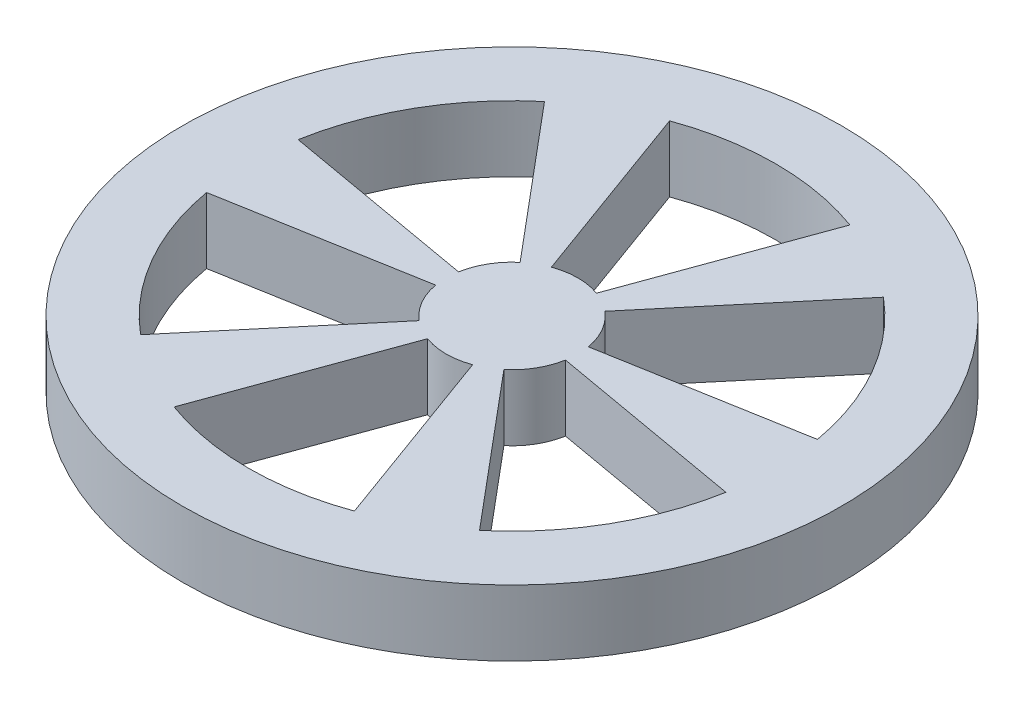
ISO-10303-21;
HEADER;
FILE_DESCRIPTION(('STEP AP214'),'2;1');
FILE_NAME('part.step','',(''),(''),'','','');
FILE_SCHEMA(('AUTOMOTIVE_DESIGN { 1 0 10303 214 1 1 1 1 }'));
ENDSEC;
DATA;
#1=APPLICATION_CONTEXT('core data for automotive mechanical design processes');
#2=APPLICATION_PROTOCOL_DEFINITION('international standard','automotive_design',2000,#1);
#3=PRODUCT_CONTEXT('',#1,'mechanical');
#4=PRODUCT('Part','Part','',(#3));
#5=PRODUCT_RELATED_PRODUCT_CATEGORY('part','',(#4));
#6=PRODUCT_DEFINITION_FORMATION('','',#4);
#7=PRODUCT_DEFINITION_CONTEXT('part definition',#1,'design');
#8=PRODUCT_DEFINITION('design','',#6,#7);
#9=PRODUCT_DEFINITION_SHAPE('','',#8);
#10=(LENGTH_UNIT() NAMED_UNIT(*) SI_UNIT(.MILLI.,.METRE.));
#11=(NAMED_UNIT(*) PLANE_ANGLE_UNIT() SI_UNIT($,.RADIAN.));
#12=(NAMED_UNIT(*) SI_UNIT($,.STERADIAN.) SOLID_ANGLE_UNIT());
#13=UNCERTAINTY_MEASURE_WITH_UNIT(LENGTH_MEASURE(1.E-05),#10,'distance_accuracy_value','');
#14=(GEOMETRIC_REPRESENTATION_CONTEXT(3) GLOBAL_UNCERTAINTY_ASSIGNED_CONTEXT((#13)) GLOBAL_UNIT_ASSIGNED_CONTEXT((#10,
#11,#12)) REPRESENTATION_CONTEXT('',''));
#15=CARTESIAN_POINT('',(0.,0.,0.));
#16=DIRECTION('',(0.,0.,1.));
#17=DIRECTION('',(1.,0.,0.));
#18=AXIS2_PLACEMENT_3D('',#15,#16,#17);
#19=CARTESIAN_POINT('',(0.,10.,0.));
#20=DIRECTION('',(0.,1.,0.));
#21=DIRECTION('',(0.,0.,1.));
#22=AXIS2_PLACEMENT_3D('',#19,#20,#21);
#23=PLANE('',#22);
#24=CARTESIAN_POINT('',(0.,10.,0.));
#25=DIRECTION('',(0.,1.,0.));
#26=DIRECTION('',(0.,0.,1.));
#27=AXIS2_PLACEMENT_3D('',#24,#25,#26);
#28=CIRCLE('',#27,50.);
#29=CARTESIAN_POINT('',(0.,10.,50.));
#30=VERTEX_POINT('',#29);
#31=EDGE_CURVE('E11',#30,#30,#28,.T.);
#32=ORIENTED_EDGE('',*,*,#31,.T.);
#33=EDGE_LOOP('',(#32));
#34=FACE_BOUND('',#33,.T.);
#35=DIRECTION('',(0.342020143325669,0.,-0.939692620785908));
#36=VECTOR('',#35,1.);
#37=CARTESIAN_POINT('',(3.42020143325669,10.,-9.39692620785908));
#38=LINE('',#37,#36);
#39=CARTESIAN_POINT('',(3.42020143325669,10.,-9.39692620785908));
#40=VERTEX_POINT('',#39);
#41=CARTESIAN_POINT('',(13.6808057330268,10.,-37.5877048314363));
#42=VERTEX_POINT('',#41);
#43=EDGE_CURVE('E424',#40,#42,#38,.T.);
#44=ORIENTED_EDGE('',*,*,#43,.F.);
#45=CARTESIAN_POINT('',(0.,10.,0.));
#46=DIRECTION('',(0.,-1.,0.));
#47=DIRECTION('',(0.,0.,1.));
#48=AXIS2_PLACEMENT_3D('',#45,#46,#47);
#49=CIRCLE('',#48,10.);
#50=CARTESIAN_POINT('',(-3.42020143325669,10.,-9.39692620785908));
#51=VERTEX_POINT('',#50);
#52=EDGE_CURVE('E421',#51,#40,#49,.T.);
#53=ORIENTED_EDGE('',*,*,#52,.F.);
#54=DIRECTION('',(0.342020143325669,0.,0.939692620785908));
#55=VECTOR('',#54,1.);
#56=CARTESIAN_POINT('',(-3.42020143325669,10.,-9.39692620785908));
#57=LINE('',#56,#55);
#58=CARTESIAN_POINT('',(-13.6808057330268,10.,-37.5877048314363));
#59=VERTEX_POINT('',#58);
#60=EDGE_CURVE('E432',#59,#51,#57,.T.);
#61=ORIENTED_EDGE('',*,*,#60,.F.);
#62=CARTESIAN_POINT('',(0.,10.,0.));
#63=DIRECTION('',(0.,1.,0.));
#64=DIRECTION('',(0.,0.,1.));
#65=AXIS2_PLACEMENT_3D('',#62,#63,#64);
#66=CIRCLE('',#65,40.);
#67=EDGE_CURVE('E428',#42,#59,#66,.T.);
#68=ORIENTED_EDGE('',*,*,#67,.F.);
#69=EDGE_LOOP('',(#44,#53,#61,#68));
#70=FACE_BOUND('',#69,.T.);
#71=DIRECTION('',(0.984807753012208,0.,-0.173648177666927));
#72=VECTOR('',#71,1.);
#73=CARTESIAN_POINT('',(9.84857753012214,10.,-1.73734780207334));
#74=LINE('',#73,#72);
#75=CARTESIAN_POINT('',(9.84857753012214,10.,-1.73734780207334));
#76=VERTEX_POINT('',#75);
#77=CARTESIAN_POINT('',(39.3928101204884,10.,-6.94679313208116));
#78=VERTEX_POINT('',#77);
#79=EDGE_CURVE('E381',#76,#78,#74,.T.);
#80=ORIENTED_EDGE('',*,*,#79,.F.);
#81=CARTESIAN_POINT('',(0.000500000000050814,10.,-0.000866025404066737));
#82=DIRECTION('',(0.,-1.,0.));
#83=DIRECTION('',(0.,0.,1.));
#84=AXIS2_PLACEMENT_3D('',#81,#82,#83);
#85=CIRCLE('',#84,10.);
#86=CARTESIAN_POINT('',(6.42837609686546,10.,-7.66131045659384));
#87=VERTEX_POINT('',#86);
#88=EDGE_CURVE('E378',#87,#76,#85,.T.);
#89=ORIENTED_EDGE('',*,*,#88,.F.);
#90=DIRECTION('',(-0.64278760968654,0.,0.766044443118977));
#91=VECTOR('',#90,1.);
#92=CARTESIAN_POINT('',(6.42837609686546,10.,-7.66131045659384));
#93=LINE('',#92,#91);
#94=CARTESIAN_POINT('',(25.7120043874617,10.,-30.6426437501631));
#95=VERTEX_POINT('',#94);
#96=EDGE_CURVE('E389',#95,#87,#93,.T.);
#97=ORIENTED_EDGE('',*,*,#96,.F.);
#98=CARTESIAN_POINT('',(0.000500000000050814,10.,-0.000866025404066737));
#99=DIRECTION('',(0.,1.,0.));
#100=DIRECTION('',(0.,0.,1.));
#101=AXIS2_PLACEMENT_3D('',#98,#99,#100);
#102=CIRCLE('',#101,40.);
#103=EDGE_CURVE('E385',#78,#95,#102,.T.);
#104=ORIENTED_EDGE('',*,*,#103,.F.);
#105=EDGE_LOOP('',(#80,#89,#97,#104));
#106=FACE_BOUND('',#105,.T.);
#107=DIRECTION('',(0.642787609686535,0.,0.766044443118981));
#108=VECTOR('',#107,1.);
#109=CARTESIAN_POINT('',(6.42937609686567,10.,7.65957840578565));
#110=LINE('',#109,#108);
#111=CARTESIAN_POINT('',(6.42937609686567,10.,7.65957840578565));
#112=VERTEX_POINT('',#111);
#113=CARTESIAN_POINT('',(25.7130043874617,10.,30.6409116993551));
#114=VERTEX_POINT('',#113);
#115=EDGE_CURVE('E338',#112,#114,#110,.T.);
#116=ORIENTED_EDGE('',*,*,#115,.F.);
#117=CARTESIAN_POINT('',(0.0015000000003207,10.,-0.000866025404163878));
#118=DIRECTION('',(0.,-1.,0.));
#119=DIRECTION('',(0.,0.,1.));
#120=AXIS2_PLACEMENT_3D('',#117,#118,#119);
#121=CIRCLE('',#120,10.);
#122=CARTESIAN_POINT('',(9.8495775301224,10.,1.73561575126518));
#123=VERTEX_POINT('',#122);
#124=EDGE_CURVE('E335',#123,#112,#121,.T.);
#125=ORIENTED_EDGE('',*,*,#124,.F.);
#126=DIRECTION('',(-0.984807753012207,0.,-0.173648177666934));
#127=VECTOR('',#126,1.);
#128=CARTESIAN_POINT('',(9.8495775301224,10.,1.73561575126518));
#129=LINE('',#128,#127);
#130=CARTESIAN_POINT('',(39.3938101204886,10.,6.94506108127321));
#131=VERTEX_POINT('',#130);
#132=EDGE_CURVE('E346',#131,#123,#129,.T.);
#133=ORIENTED_EDGE('',*,*,#132,.F.);
#134=CARTESIAN_POINT('',(0.0015000000003207,10.,-0.000866025404163878));
#135=DIRECTION('',(0.,1.,0.));
#136=DIRECTION('',(0.,0.,1.));
#137=AXIS2_PLACEMENT_3D('',#134,#135,#136);
#138=CIRCLE('',#137,40.);
#139=EDGE_CURVE('E342',#114,#131,#138,.T.);
#140=ORIENTED_EDGE('',*,*,#139,.F.);
#141=EDGE_LOOP('',(#116,#125,#133,#140));
#142=FACE_BOUND('',#141,.T.);
#143=DIRECTION('',(-0.342020143325676,0.,0.939692620785906));
#144=VECTOR('',#143,1.);
#145=CARTESIAN_POINT('',(-3.41820143325622,10.,9.39692620785886));
#146=LINE('',#145,#144);
#147=CARTESIAN_POINT('',(-3.41820143325622,10.,9.39692620785886));
#148=VERTEX_POINT('',#147);
#149=CARTESIAN_POINT('',(-13.6788057330265,10.,37.587704831436));
#150=VERTEX_POINT('',#149);
#151=EDGE_CURVE('E295',#148,#150,#146,.T.);
#152=ORIENTED_EDGE('',*,*,#151,.F.);
#153=CARTESIAN_POINT('',(0.00200000000053976,10.,-1.94282046346723E-13));
#154=DIRECTION('',(0.,-1.,0.));
#155=DIRECTION('',(0.,0.,1.));
#156=AXIS2_PLACEMENT_3D('',#153,#154,#155);
#157=CIRCLE('',#156,10.);
#158=CARTESIAN_POINT('',(3.42220143325717,10.,9.39692620785891));
#159=VERTEX_POINT('',#158);
#160=EDGE_CURVE('E292',#159,#148,#157,.T.);
#161=ORIENTED_EDGE('',*,*,#160,.F.);
#162=DIRECTION('',(-0.342020143325663,0.,-0.939692620785911));
#163=VECTOR('',#162,1.);
#164=CARTESIAN_POINT('',(3.42220143325717,10.,9.39692620785891));
#165=LINE('',#164,#163);
#166=CARTESIAN_POINT('',(13.6828057330271,10.,37.5877048314362));
#167=VERTEX_POINT('',#166);
#168=EDGE_CURVE('E303',#167,#159,#165,.T.);
#169=ORIENTED_EDGE('',*,*,#168,.F.);
#170=CARTESIAN_POINT('',(0.00200000000053976,10.,-1.94282046346723E-13));
#171=DIRECTION('',(0.,1.,0.));
#172=DIRECTION('',(0.,0.,1.));
#173=AXIS2_PLACEMENT_3D('',#170,#171,#172);
#174=CIRCLE('',#173,40.);
#175=EDGE_CURVE('E299',#150,#167,#174,.T.);
#176=ORIENTED_EDGE('',*,*,#175,.F.);
#177=EDGE_LOOP('',(#152,#161,#169,#176));
#178=FACE_BOUND('',#177,.T.);
#179=DIRECTION('',(-0.98480775301221,0.,0.17364817766692));
#180=VECTOR('',#179,1.);
#181=CARTESIAN_POINT('',(-9.84657753012161,10.,1.73734780207308));
#182=LINE('',#181,#180);
#183=CARTESIAN_POINT('',(-9.84657753012161,10.,1.73734780207308));
#184=VERTEX_POINT('',#183);
#185=CARTESIAN_POINT('',(-39.3908101204879,10.,6.94679313208069));
#186=VERTEX_POINT('',#185);
#187=EDGE_CURVE('E252',#184,#186,#182,.T.);
#188=ORIENTED_EDGE('',*,*,#187,.F.);
#189=CARTESIAN_POINT('',(0.00150000000048894,10.,0.000866025403872451));
#190=DIRECTION('',(0.,-1.,0.));
#191=DIRECTION('',(0.,0.,1.));
#192=AXIS2_PLACEMENT_3D('',#189,#190,#191);
#193=CIRCLE('',#192,10.);
#194=CARTESIAN_POINT('',(-6.42637609686497,10.,7.6613104565936));
#195=VERTEX_POINT('',#194);
#196=EDGE_CURVE('E249',#195,#184,#193,.T.);
#197=ORIENTED_EDGE('',*,*,#196,.F.);
#198=DIRECTION('',(0.642787609686546,0.,-0.766044443118973));
#199=VECTOR('',#198,1.);
#200=CARTESIAN_POINT('',(-6.42637609686497,10.,7.6613104565936));
#201=LINE('',#200,#199);
#202=CARTESIAN_POINT('',(-25.7100043874613,10.,30.6426437501628));
#203=VERTEX_POINT('',#202);
#204=EDGE_CURVE('E260',#203,#195,#201,.T.);
#205=ORIENTED_EDGE('',*,*,#204,.F.);
#206=CARTESIAN_POINT('',(0.00150000000048894,10.,0.000866025403872451));
#207=DIRECTION('',(0.,1.,0.));
#208=DIRECTION('',(0.,0.,1.));
#209=AXIS2_PLACEMENT_3D('',#206,#207,#208);
#210=CIRCLE('',#209,40.);
#211=EDGE_CURVE('E256',#186,#203,#210,.T.);
#212=ORIENTED_EDGE('',*,*,#211,.F.);
#213=EDGE_LOOP('',(#188,#197,#205,#212));
#214=FACE_BOUND('',#213,.T.);
#215=DIRECTION('',(-0.64278760968653,0.,-0.766044443118986));
#216=VECTOR('',#215,1.);
#217=CARTESIAN_POINT('',(-6.42737609686508,10.,-7.65957840578589));
#218=LINE('',#217,#216);
#219=CARTESIAN_POINT('',(-6.42737609686508,10.,-7.65957840578589));
#220=VERTEX_POINT('',#219);
#221=CARTESIAN_POINT('',(-25.711004387461,10.,-30.6409116993555));
#222=VERTEX_POINT('',#221);
#223=EDGE_CURVE('E210',#220,#222,#218,.T.);
#224=ORIENTED_EDGE('',*,*,#223,.F.);
#225=CARTESIAN_POINT('',(0.000500000000219061,10.,0.000866025403969586));
#226=DIRECTION('',(0.,-1.,0.));
#227=DIRECTION('',(0.,0.,1.));
#228=AXIS2_PLACEMENT_3D('',#225,#226,#227);
#229=CIRCLE('',#228,10.);
#230=CARTESIAN_POINT('',(-9.84757753012184,10.,-1.73561575126544));
#231=VERTEX_POINT('',#230);
#232=EDGE_CURVE('E201',#231,#220,#229,.T.);
#233=ORIENTED_EDGE('',*,*,#232,.F.);
#234=DIRECTION('',(0.984807753012206,0.,0.173648177666941));
#235=VECTOR('',#234,1.);
#236=CARTESIAN_POINT('',(-9.84757753012184,10.,-1.73561575126544));
#237=LINE('',#236,#235);
#238=CARTESIAN_POINT('',(-39.391810120488,10.,-6.94506108127367));
#239=VERTEX_POINT('',#238);
#240=EDGE_CURVE('E227',#239,#231,#237,.T.);
#241=ORIENTED_EDGE('',*,*,#240,.F.);
#242=CARTESIAN_POINT('',(0.000500000000219061,10.,0.000866025403969586));
#243=DIRECTION('',(0.,1.,0.));
#244=DIRECTION('',(0.,0.,1.));
#245=AXIS2_PLACEMENT_3D('',#242,#243,#244);
#246=CIRCLE('',#245,40.);
#247=EDGE_CURVE('E223',#222,#239,#246,.T.);
#248=ORIENTED_EDGE('',*,*,#247,.F.);
#249=EDGE_LOOP('',(#224,#233,#241,#248));
#250=FACE_BOUND('',#249,.T.);
#251=ADVANCED_FACE('F39',(#34,#70,#106,#142,#178,#214,#250),#23,.T.);
#252=CARTESIAN_POINT('',(0.,0.,0.));
#253=DIRECTION('',(0.,1.,0.));
#254=DIRECTION('',(0.,0.,1.));
#255=AXIS2_PLACEMENT_3D('',#252,#253,#254);
#256=PLANE('',#255);
#257=CARTESIAN_POINT('',(0.00150000000048894,0.,0.000866025403872451));
#258=DIRECTION('',(0.,-1.,0.));
#259=DIRECTION('',(0.,0.,1.));
#260=AXIS2_PLACEMENT_3D('',#257,#258,#259);
#261=CIRCLE('',#260,10.);
#262=CARTESIAN_POINT('',(-6.42637609686497,0.,7.6613104565936));
#263=VERTEX_POINT('',#262);
#264=CARTESIAN_POINT('',(-9.84657753012161,0.,1.73734780207308));
#265=VERTEX_POINT('',#264);
#266=EDGE_CURVE('E219',#263,#265,#261,.T.);
#267=ORIENTED_EDGE('',*,*,#266,.T.);
#268=DIRECTION('',(-0.98480775301221,0.,0.17364817766692));
#269=VECTOR('',#268,1.);
#270=CARTESIAN_POINT('',(-9.84657753012161,0.,1.73734780207308));
#271=LINE('',#270,#269);
#272=CARTESIAN_POINT('',(-39.3908101204879,0.,6.94679313208069));
#273=VERTEX_POINT('',#272);
#274=EDGE_CURVE('E267',#265,#273,#271,.T.);
#275=ORIENTED_EDGE('',*,*,#274,.T.);
#276=CARTESIAN_POINT('',(0.00150000000048894,0.,0.000866025403872451));
#277=DIRECTION('',(0.,1.,0.));
#278=DIRECTION('',(0.,0.,1.));
#279=AXIS2_PLACEMENT_3D('',#276,#277,#278);
#280=CIRCLE('',#279,40.);
#281=CARTESIAN_POINT('',(-25.7100043874613,0.,30.6426437501628));
#282=VERTEX_POINT('',#281);
#283=EDGE_CURVE('E271',#273,#282,#280,.T.);
#284=ORIENTED_EDGE('',*,*,#283,.T.);
#285=DIRECTION('',(0.642787609686546,0.,-0.766044443118973));
#286=VECTOR('',#285,1.);
#287=CARTESIAN_POINT('',(-6.42637609686497,0.,7.6613104565936));
#288=LINE('',#287,#286);
#289=EDGE_CURVE('E253',#282,#263,#288,.T.);
#290=ORIENTED_EDGE('',*,*,#289,.T.);
#291=EDGE_LOOP('',(#267,#275,#284,#290));
#292=FACE_BOUND('',#291,.T.);
#293=CARTESIAN_POINT('',(0.0015000000003207,0.,-0.000866025404163878));
#294=DIRECTION('',(0.,-1.,0.));
#295=DIRECTION('',(0.,0.,1.));
#296=AXIS2_PLACEMENT_3D('',#293,#294,#295);
#297=CIRCLE('',#296,10.);
#298=CARTESIAN_POINT('',(9.8495775301224,0.,1.73561575126518));
#299=VERTEX_POINT('',#298);
#300=CARTESIAN_POINT('',(6.42937609686567,0.,7.65957840578565));
#301=VERTEX_POINT('',#300);
#302=EDGE_CURVE('E334',#299,#301,#297,.T.);
#303=ORIENTED_EDGE('',*,*,#302,.T.);
#304=DIRECTION('',(0.642787609686535,0.,0.766044443118981));
#305=VECTOR('',#304,1.);
#306=CARTESIAN_POINT('',(6.42937609686567,0.,7.65957840578565));
#307=LINE('',#306,#305);
#308=CARTESIAN_POINT('',(25.7130043874617,0.,30.6409116993551));
#309=VERTEX_POINT('',#308);
#310=EDGE_CURVE('E353',#301,#309,#307,.T.);
#311=ORIENTED_EDGE('',*,*,#310,.T.);
#312=CARTESIAN_POINT('',(0.0015000000003207,0.,-0.000866025404163878));
#313=DIRECTION('',(0.,1.,0.));
#314=DIRECTION('',(0.,0.,1.));
#315=AXIS2_PLACEMENT_3D('',#312,#313,#314);
#316=CIRCLE('',#315,40.);
#317=CARTESIAN_POINT('',(39.3938101204886,0.,6.9450610812732));
#318=VERTEX_POINT('',#317);
#319=EDGE_CURVE('E357',#309,#318,#316,.T.);
#320=ORIENTED_EDGE('',*,*,#319,.T.);
#321=DIRECTION('',(-0.984807753012207,0.,-0.173648177666934));
#322=VECTOR('',#321,1.);
#323=CARTESIAN_POINT('',(9.8495775301224,0.,1.73561575126518));
#324=LINE('',#323,#322);
#325=EDGE_CURVE('E339',#318,#299,#324,.T.);
#326=ORIENTED_EDGE('',*,*,#325,.T.);
#327=EDGE_LOOP('',(#303,#311,#320,#326));
#328=FACE_BOUND('',#327,.T.);
#329=CARTESIAN_POINT('',(0.,0.,0.));
#330=DIRECTION('',(0.,-1.,0.));
#331=DIRECTION('',(0.,0.,1.));
#332=AXIS2_PLACEMENT_3D('',#329,#330,#331);
#333=CIRCLE('',#332,10.);
#334=CARTESIAN_POINT('',(-3.42020143325669,0.,-9.39692620785908));
#335=VERTEX_POINT('',#334);
#336=CARTESIAN_POINT('',(3.42020143325669,0.,-9.39692620785908));
#337=VERTEX_POINT('',#336);
#338=EDGE_CURVE('E420',#335,#337,#333,.T.);
#339=ORIENTED_EDGE('',*,*,#338,.T.);
#340=DIRECTION('',(0.342020143325669,0.,-0.939692620785908));
#341=VECTOR('',#340,1.);
#342=CARTESIAN_POINT('',(3.42020143325669,0.,-9.39692620785908));
#343=LINE('',#342,#341);
#344=CARTESIAN_POINT('',(13.6808057330268,0.,-37.5877048314363));
#345=VERTEX_POINT('',#344);
#346=EDGE_CURVE('E439',#337,#345,#343,.T.);
#347=ORIENTED_EDGE('',*,*,#346,.T.);
#348=CARTESIAN_POINT('',(0.,0.,0.));
#349=DIRECTION('',(0.,1.,0.));
#350=DIRECTION('',(0.,0.,1.));
#351=AXIS2_PLACEMENT_3D('',#348,#349,#350);
#352=CIRCLE('',#351,40.);
#353=CARTESIAN_POINT('',(-13.6808057330268,0.,-37.5877048314363));
#354=VERTEX_POINT('',#353);
#355=EDGE_CURVE('E443',#345,#354,#352,.T.);
#356=ORIENTED_EDGE('',*,*,#355,.T.);
#357=DIRECTION('',(0.342020143325669,0.,0.939692620785908));
#358=VECTOR('',#357,1.);
#359=CARTESIAN_POINT('',(-3.42020143325669,0.,-9.39692620785908));
#360=LINE('',#359,#358);
#361=EDGE_CURVE('E425',#354,#335,#360,.T.);
#362=ORIENTED_EDGE('',*,*,#361,.T.);
#363=EDGE_LOOP('',(#339,#347,#356,#362));
#364=FACE_BOUND('',#363,.T.);
#365=CARTESIAN_POINT('',(0.,0.,0.));
#366=DIRECTION('',(0.,1.,0.));
#367=DIRECTION('',(0.,0.,1.));
#368=AXIS2_PLACEMENT_3D('',#365,#366,#367);
#369=CIRCLE('',#368,50.);
#370=CARTESIAN_POINT('',(0.,0.,50.));
#371=VERTEX_POINT('',#370);
#372=EDGE_CURVE('E43',#371,#371,#369,.T.);
#373=ORIENTED_EDGE('',*,*,#372,.F.);
#374=EDGE_LOOP('',(#373));
#375=FACE_BOUND('',#374,.T.);
#376=CARTESIAN_POINT('',(0.000500000000050814,0.,-0.000866025404066737));
#377=DIRECTION('',(0.,-1.,0.));
#378=DIRECTION('',(0.,0.,1.));
#379=AXIS2_PLACEMENT_3D('',#376,#377,#378);
#380=CIRCLE('',#379,10.);
#381=CARTESIAN_POINT('',(6.42837609686546,0.,-7.66131045659384));
#382=VERTEX_POINT('',#381);
#383=CARTESIAN_POINT('',(9.84857753012214,0.,-1.73734780207334));
#384=VERTEX_POINT('',#383);
#385=EDGE_CURVE('E377',#382,#384,#380,.T.);
#386=ORIENTED_EDGE('',*,*,#385,.T.);
#387=DIRECTION('',(0.984807753012208,0.,-0.173648177666927));
#388=VECTOR('',#387,1.);
#389=CARTESIAN_POINT('',(9.84857753012214,0.,-1.73734780207334));
#390=LINE('',#389,#388);
#391=CARTESIAN_POINT('',(39.3928101204884,0.,-6.94679313208116));
#392=VERTEX_POINT('',#391);
#393=EDGE_CURVE('E396',#384,#392,#390,.T.);
#394=ORIENTED_EDGE('',*,*,#393,.T.);
#395=CARTESIAN_POINT('',(0.000500000000050814,0.,-0.000866025404066737));
#396=DIRECTION('',(0.,1.,0.));
#397=DIRECTION('',(0.,0.,1.));
#398=AXIS2_PLACEMENT_3D('',#395,#396,#397);
#399=CIRCLE('',#398,40.);
#400=CARTESIAN_POINT('',(25.7120043874617,0.,-30.6426437501631));
#401=VERTEX_POINT('',#400);
#402=EDGE_CURVE('E400',#392,#401,#399,.T.);
#403=ORIENTED_EDGE('',*,*,#402,.T.);
#404=DIRECTION('',(-0.64278760968654,0.,0.766044443118977));
#405=VECTOR('',#404,1.);
#406=CARTESIAN_POINT('',(6.42837609686546,0.,-7.66131045659384));
#407=LINE('',#406,#405);
#408=EDGE_CURVE('E382',#401,#382,#407,.T.);
#409=ORIENTED_EDGE('',*,*,#408,.T.);
#410=EDGE_LOOP('',(#386,#394,#403,#409));
#411=FACE_BOUND('',#410,.T.);
#412=CARTESIAN_POINT('',(0.00200000000053976,0.,-1.94282046346723E-13));
#413=DIRECTION('',(0.,-1.,0.));
#414=DIRECTION('',(0.,0.,1.));
#415=AXIS2_PLACEMENT_3D('',#412,#413,#414);
#416=CIRCLE('',#415,10.);
#417=CARTESIAN_POINT('',(3.42220143325717,0.,9.39692620785891));
#418=VERTEX_POINT('',#417);
#419=CARTESIAN_POINT('',(-3.41820143325622,0.,9.39692620785886));
#420=VERTEX_POINT('',#419);
#421=EDGE_CURVE('E291',#418,#420,#416,.T.);
#422=ORIENTED_EDGE('',*,*,#421,.T.);
#423=DIRECTION('',(-0.342020143325676,0.,0.939692620785906));
#424=VECTOR('',#423,1.);
#425=CARTESIAN_POINT('',(-3.41820143325622,0.,9.39692620785886));
#426=LINE('',#425,#424);
#427=CARTESIAN_POINT('',(-13.6788057330265,0.,37.587704831436));
#428=VERTEX_POINT('',#427);
#429=EDGE_CURVE('E310',#420,#428,#426,.T.);
#430=ORIENTED_EDGE('',*,*,#429,.T.);
#431=CARTESIAN_POINT('',(0.00200000000053976,0.,-1.94282046346723E-13));
#432=DIRECTION('',(0.,1.,0.));
#433=DIRECTION('',(0.,0.,1.));
#434=AXIS2_PLACEMENT_3D('',#431,#432,#433);
#435=CIRCLE('',#434,40.);
#436=CARTESIAN_POINT('',(13.682805733027,0.,37.5877048314362));
#437=VERTEX_POINT('',#436);
#438=EDGE_CURVE('E314',#428,#437,#435,.T.);
#439=ORIENTED_EDGE('',*,*,#438,.T.);
#440=DIRECTION('',(-0.342020143325663,0.,-0.939692620785911));
#441=VECTOR('',#440,1.);
#442=CARTESIAN_POINT('',(3.42220143325717,0.,9.39692620785891));
#443=LINE('',#442,#441);
#444=EDGE_CURVE('E296',#437,#418,#443,.T.);
#445=ORIENTED_EDGE('',*,*,#444,.T.);
#446=EDGE_LOOP('',(#422,#430,#439,#445));
#447=FACE_BOUND('',#446,.T.);
#448=CARTESIAN_POINT('',(0.000500000000219061,0.,0.000866025403969586));
#449=DIRECTION('',(0.,-1.,0.));
#450=DIRECTION('',(0.,0.,1.));
#451=AXIS2_PLACEMENT_3D('',#448,#449,#450);
#452=CIRCLE('',#451,10.);
#453=CARTESIAN_POINT('',(-9.84757753012184,0.,-1.73561575126544));
#454=VERTEX_POINT('',#453);
#455=CARTESIAN_POINT('',(-6.42737609686508,0.,-7.65957840578589));
#456=VERTEX_POINT('',#455);
#457=EDGE_CURVE('E63',#454,#456,#452,.T.);
#458=ORIENTED_EDGE('',*,*,#457,.T.);
#459=DIRECTION('',(-0.64278760968653,0.,-0.766044443118986));
#460=VECTOR('',#459,1.);
#461=CARTESIAN_POINT('',(-6.42737609686508,0.,-7.65957840578589));
#462=LINE('',#461,#460);
#463=CARTESIAN_POINT('',(-25.711004387461,0.,-30.6409116993555));
#464=VERTEX_POINT('',#463);
#465=EDGE_CURVE('E217',#456,#464,#462,.T.);
#466=ORIENTED_EDGE('',*,*,#465,.T.);
#467=CARTESIAN_POINT('',(0.000500000000219061,0.,0.000866025403969586));
#468=DIRECTION('',(0.,1.,0.));
#469=DIRECTION('',(0.,0.,1.));
#470=AXIS2_PLACEMENT_3D('',#467,#468,#469);
#471=CIRCLE('',#470,40.);
#472=CARTESIAN_POINT('',(-39.391810120488,0.,-6.94506108127366));
#473=VERTEX_POINT('',#472);
#474=EDGE_CURVE('E236',#464,#473,#471,.T.);
#475=ORIENTED_EDGE('',*,*,#474,.T.);
#476=DIRECTION('',(0.984807753012206,0.,0.173648177666941));
#477=VECTOR('',#476,1.);
#478=CARTESIAN_POINT('',(-9.84757753012184,0.,-1.73561575126544));
#479=LINE('',#478,#477);
#480=EDGE_CURVE('E211',#473,#454,#479,.T.);
#481=ORIENTED_EDGE('',*,*,#480,.T.);
#482=EDGE_LOOP('',(#458,#466,#475,#481));
#483=FACE_BOUND('',#482,.T.);
#484=ADVANCED_FACE('F469',(#292,#328,#364,#375,#411,#447,#483),#256,.F.);
#485=CARTESIAN_POINT('',(0.,10.,0.));
#486=DIRECTION('',(0.,-1.,0.));
#487=DIRECTION('',(0.,0.,-1.));
#488=AXIS2_PLACEMENT_3D('',#485,#486,#487);
#489=CYLINDRICAL_SURFACE('',#488,50.);
#490=ORIENTED_EDGE('',*,*,#31,.F.);
#491=EDGE_LOOP('',(#490));
#492=FACE_BOUND('',#491,.T.);
#493=ORIENTED_EDGE('',*,*,#372,.T.);
#494=EDGE_LOOP('',(#493));
#495=FACE_BOUND('',#494,.T.);
#496=ADVANCED_FACE('F41',(#492,#495),#489,.T.);
#497=CARTESIAN_POINT('',(0.,10.,0.));
#498=DIRECTION('',(0.,-1.,0.));
#499=DIRECTION('',(0.,0.,-1.));
#500=AXIS2_PLACEMENT_3D('',#497,#498,#499);
#501=CYLINDRICAL_SURFACE('',#500,10.);
#502=ORIENTED_EDGE('',*,*,#338,.F.);
#503=DIRECTION('',(0.,-1.,0.));
#504=VECTOR('',#503,1.);
#505=CARTESIAN_POINT('',(-3.42020143325669,10.,-9.39692620785908));
#506=LINE('',#505,#504);
#507=EDGE_CURVE('E435',#51,#335,#506,.T.);
#508=ORIENTED_EDGE('',*,*,#507,.F.);
#509=ORIENTED_EDGE('',*,*,#52,.T.);
#510=DIRECTION('',(0.,-1.,0.));
#511=VECTOR('',#510,1.);
#512=CARTESIAN_POINT('',(3.42020143325669,10.,-9.39692620785908));
#513=LINE('',#512,#511);
#514=EDGE_CURVE('E459',#40,#337,#513,.T.);
#515=ORIENTED_EDGE('',*,*,#514,.T.);
#516=EDGE_LOOP('',(#502,#508,#509,#515));
#517=FACE_BOUND('',#516,.T.);
#518=ADVANCED_FACE('F492',(#517),#501,.T.);
#519=CARTESIAN_POINT('',(3.42020143325669,10.,-9.39692620785908));
#520=DIRECTION('',(-0.939692620785908,0.,-0.342020143325669));
#521=DIRECTION('',(-0.342020143325669,0.,0.939692620785908));
#522=AXIS2_PLACEMENT_3D('',#519,#520,#521);
#523=PLANE('',#522);
#524=ORIENTED_EDGE('',*,*,#346,.F.);
#525=ORIENTED_EDGE('',*,*,#514,.F.);
#526=ORIENTED_EDGE('',*,*,#43,.T.);
#527=DIRECTION('',(0.,-1.,0.));
#528=VECTOR('',#527,1.);
#529=CARTESIAN_POINT('',(13.6808057330268,10.,-37.5877048314363));
#530=LINE('',#529,#528);
#531=EDGE_CURVE('E456',#42,#345,#530,.T.);
#532=ORIENTED_EDGE('',*,*,#531,.T.);
#533=EDGE_LOOP('',(#524,#525,#526,#532));
#534=FACE_BOUND('',#533,.T.);
#535=ADVANCED_FACE('F495',(#534),#523,.T.);
#536=CARTESIAN_POINT('',(0.,10.,0.));
#537=DIRECTION('',(0.,-1.,0.));
#538=DIRECTION('',(0.,0.,-1.));
#539=AXIS2_PLACEMENT_3D('',#536,#537,#538);
#540=CYLINDRICAL_SURFACE('',#539,40.);
#541=ORIENTED_EDGE('',*,*,#355,.F.);
#542=ORIENTED_EDGE('',*,*,#531,.F.);
#543=ORIENTED_EDGE('',*,*,#67,.T.);
#544=DIRECTION('',(0.,-1.,0.));
#545=VECTOR('',#544,1.);
#546=CARTESIAN_POINT('',(-13.6808057330268,10.,-37.5877048314363));
#547=LINE('',#546,#545);
#548=EDGE_CURVE('E453',#59,#354,#547,.T.);
#549=ORIENTED_EDGE('',*,*,#548,.T.);
#550=EDGE_LOOP('',(#541,#542,#543,#549));
#551=FACE_BOUND('',#550,.T.);
#552=ADVANCED_FACE('F498',(#551),#540,.F.);
#553=CARTESIAN_POINT('',(-3.42020143325669,10.,-9.39692620785908));
#554=DIRECTION('',(0.939692620785908,0.,-0.342020143325669));
#555=DIRECTION('',(-0.342020143325669,0.,-0.939692620785908));
#556=AXIS2_PLACEMENT_3D('',#553,#554,#555);
#557=PLANE('',#556);
#558=ORIENTED_EDGE('',*,*,#361,.F.);
#559=ORIENTED_EDGE('',*,*,#548,.F.);
#560=ORIENTED_EDGE('',*,*,#60,.T.);
#561=ORIENTED_EDGE('',*,*,#507,.T.);
#562=EDGE_LOOP('',(#558,#559,#560,#561));
#563=FACE_BOUND('',#562,.T.);
#564=ADVANCED_FACE('F502',(#563),#557,.T.);
#565=CARTESIAN_POINT('',(0.000500000000050814,10.,-0.000866025404066737));
#566=DIRECTION('',(0.,-1.,0.));
#567=DIRECTION('',(0.,0.,-1.));
#568=AXIS2_PLACEMENT_3D('',#565,#566,#567);
#569=CYLINDRICAL_SURFACE('',#568,10.);
#570=ORIENTED_EDGE('',*,*,#385,.F.);
#571=DIRECTION('',(0.,-1.,0.));
#572=VECTOR('',#571,1.);
#573=CARTESIAN_POINT('',(6.42837609686546,10.,-7.66131045659384));
#574=LINE('',#573,#572);
#575=EDGE_CURVE('E392',#87,#382,#574,.T.);
#576=ORIENTED_EDGE('',*,*,#575,.F.);
#577=ORIENTED_EDGE('',*,*,#88,.T.);
#578=DIRECTION('',(0.,-1.,0.));
#579=VECTOR('',#578,1.);
#580=CARTESIAN_POINT('',(9.84857753012214,10.,-1.73734780207334));
#581=LINE('',#580,#579);
#582=EDGE_CURVE('E416',#76,#384,#581,.T.);
#583=ORIENTED_EDGE('',*,*,#582,.T.);
#584=EDGE_LOOP('',(#570,#576,#577,#583));
#585=FACE_BOUND('',#584,.T.);
#586=ADVANCED_FACE('F506',(#585),#569,.T.);
#587=CARTESIAN_POINT('',(9.84857753012214,10.,-1.73734780207334));
#588=DIRECTION('',(-0.173648177666927,0.,-0.984807753012209));
#589=DIRECTION('',(-0.984807753012209,0.,0.173648177666927));
#590=AXIS2_PLACEMENT_3D('',#587,#588,#589);
#591=PLANE('',#590);
#592=ORIENTED_EDGE('',*,*,#393,.F.);
#593=ORIENTED_EDGE('',*,*,#582,.F.);
#594=ORIENTED_EDGE('',*,*,#79,.T.);
#595=DIRECTION('',(0.,-1.,0.));
#596=VECTOR('',#595,1.);
#597=CARTESIAN_POINT('',(39.3928101204884,10.,-6.94679313208116));
#598=LINE('',#597,#596);
#599=EDGE_CURVE('E413',#78,#392,#598,.T.);
#600=ORIENTED_EDGE('',*,*,#599,.T.);
#601=EDGE_LOOP('',(#592,#593,#594,#600));
#602=FACE_BOUND('',#601,.T.);
#603=ADVANCED_FACE('F510',(#602),#591,.T.);
#604=CARTESIAN_POINT('',(0.000500000000050814,10.,-0.000866025404066737));
#605=DIRECTION('',(0.,-1.,0.));
#606=DIRECTION('',(0.,0.,-1.));
#607=AXIS2_PLACEMENT_3D('',#604,#605,#606);
#608=CYLINDRICAL_SURFACE('',#607,40.);
#609=ORIENTED_EDGE('',*,*,#402,.F.);
#610=ORIENTED_EDGE('',*,*,#599,.F.);
#611=ORIENTED_EDGE('',*,*,#103,.T.);
#612=DIRECTION('',(0.,-1.,0.));
#613=VECTOR('',#612,1.);
#614=CARTESIAN_POINT('',(25.7120043874617,10.,-30.6426437501631));
#615=LINE('',#614,#613);
#616=EDGE_CURVE('E410',#95,#401,#615,.T.);
#617=ORIENTED_EDGE('',*,*,#616,.T.);
#618=EDGE_LOOP('',(#609,#610,#611,#617));
#619=FACE_BOUND('',#618,.T.);
#620=ADVANCED_FACE('F514',(#619),#608,.F.);
#621=CARTESIAN_POINT('',(6.42837609686546,10.,-7.66131045659384));
#622=DIRECTION('',(0.766044443118977,0.,0.64278760968654));
#623=DIRECTION('',(0.64278760968654,0.,-0.766044443118977));
#624=AXIS2_PLACEMENT_3D('',#621,#622,#623);
#625=PLANE('',#624);
#626=ORIENTED_EDGE('',*,*,#408,.F.);
#627=ORIENTED_EDGE('',*,*,#616,.F.);
#628=ORIENTED_EDGE('',*,*,#96,.T.);
#629=ORIENTED_EDGE('',*,*,#575,.T.);
#630=EDGE_LOOP('',(#626,#627,#628,#629));
#631=FACE_BOUND('',#630,.T.);
#632=ADVANCED_FACE('F518',(#631),#625,.T.);
#633=CARTESIAN_POINT('',(0.0015000000003207,10.,-0.000866025404163878));
#634=DIRECTION('',(0.,-1.,0.));
#635=DIRECTION('',(0.,0.,-1.));
#636=AXIS2_PLACEMENT_3D('',#633,#634,#635);
#637=CYLINDRICAL_SURFACE('',#636,10.);
#638=ORIENTED_EDGE('',*,*,#302,.F.);
#639=DIRECTION('',(0.,-1.,0.));
#640=VECTOR('',#639,1.);
#641=CARTESIAN_POINT('',(9.8495775301224,10.,1.73561575126518));
#642=LINE('',#641,#640);
#643=EDGE_CURVE('E349',#123,#299,#642,.T.);
#644=ORIENTED_EDGE('',*,*,#643,.F.);
#645=ORIENTED_EDGE('',*,*,#124,.T.);
#646=DIRECTION('',(0.,-1.,0.));
#647=VECTOR('',#646,1.);
#648=CARTESIAN_POINT('',(6.42937609686567,10.,7.65957840578565));
#649=LINE('',#648,#647);
#650=EDGE_CURVE('E373',#112,#301,#649,.T.);
#651=ORIENTED_EDGE('',*,*,#650,.T.);
#652=EDGE_LOOP('',(#638,#644,#645,#651));
#653=FACE_BOUND('',#652,.T.);
#654=ADVANCED_FACE('F522',(#653),#637,.T.);
#655=CARTESIAN_POINT('',(6.42937609686567,10.,7.65957840578565));
#656=DIRECTION('',(0.766044443118981,0.,-0.642787609686535));
#657=DIRECTION('',(-0.642787609686535,0.,-0.766044443118982));
#658=AXIS2_PLACEMENT_3D('',#655,#656,#657);
#659=PLANE('',#658);
#660=ORIENTED_EDGE('',*,*,#310,.F.);
#661=ORIENTED_EDGE('',*,*,#650,.F.);
#662=ORIENTED_EDGE('',*,*,#115,.T.);
#663=DIRECTION('',(0.,-1.,0.));
#664=VECTOR('',#663,1.);
#665=CARTESIAN_POINT('',(25.7130043874617,10.,30.6409116993551));
#666=LINE('',#665,#664);
#667=EDGE_CURVE('E370',#114,#309,#666,.T.);
#668=ORIENTED_EDGE('',*,*,#667,.T.);
#669=EDGE_LOOP('',(#660,#661,#662,#668));
#670=FACE_BOUND('',#669,.T.);
#671=ADVANCED_FACE('F526',(#670),#659,.T.);
#672=CARTESIAN_POINT('',(0.0015000000003207,10.,-0.000866025404163878));
#673=DIRECTION('',(0.,-1.,0.));
#674=DIRECTION('',(0.,0.,-1.));
#675=AXIS2_PLACEMENT_3D('',#672,#673,#674);
#676=CYLINDRICAL_SURFACE('',#675,40.);
#677=ORIENTED_EDGE('',*,*,#319,.F.);
#678=ORIENTED_EDGE('',*,*,#667,.F.);
#679=ORIENTED_EDGE('',*,*,#139,.T.);
#680=DIRECTION('',(0.,-1.,0.));
#681=VECTOR('',#680,1.);
#682=CARTESIAN_POINT('',(39.3938101204886,10.,6.9450610812732));
#683=LINE('',#682,#681);
#684=EDGE_CURVE('E367',#131,#318,#683,.T.);
#685=ORIENTED_EDGE('',*,*,#684,.T.);
#686=EDGE_LOOP('',(#677,#678,#679,#685));
#687=FACE_BOUND('',#686,.T.);
#688=ADVANCED_FACE('F530',(#687),#676,.F.);
#689=CARTESIAN_POINT('',(9.8495775301224,10.,1.73561575126518));
#690=DIRECTION('',(-0.173648177666934,0.,0.984807753012207));
#691=DIRECTION('',(0.984807753012208,0.,0.173648177666934));
#692=AXIS2_PLACEMENT_3D('',#689,#690,#691);
#693=PLANE('',#692);
#694=ORIENTED_EDGE('',*,*,#325,.F.);
#695=ORIENTED_EDGE('',*,*,#684,.F.);
#696=ORIENTED_EDGE('',*,*,#132,.T.);
#697=ORIENTED_EDGE('',*,*,#643,.T.);
#698=EDGE_LOOP('',(#694,#695,#696,#697));
#699=FACE_BOUND('',#698,.T.);
#700=ADVANCED_FACE('F534',(#699),#693,.T.);
#701=CARTESIAN_POINT('',(0.00200000000053976,10.,-1.94282046346723E-13));
#702=DIRECTION('',(0.,-1.,0.));
#703=DIRECTION('',(0.,0.,-1.));
#704=AXIS2_PLACEMENT_3D('',#701,#702,#703);
#705=CYLINDRICAL_SURFACE('',#704,10.);
#706=ORIENTED_EDGE('',*,*,#421,.F.);
#707=DIRECTION('',(0.,-1.,0.));
#708=VECTOR('',#707,1.);
#709=CARTESIAN_POINT('',(3.42220143325717,10.,9.39692620785891));
#710=LINE('',#709,#708);
#711=EDGE_CURVE('E306',#159,#418,#710,.T.);
#712=ORIENTED_EDGE('',*,*,#711,.F.);
#713=ORIENTED_EDGE('',*,*,#160,.T.);
#714=DIRECTION('',(0.,-1.,0.));
#715=VECTOR('',#714,1.);
#716=CARTESIAN_POINT('',(-3.41820143325622,10.,9.39692620785886));
#717=LINE('',#716,#715);
#718=EDGE_CURVE('E330',#148,#420,#717,.T.);
#719=ORIENTED_EDGE('',*,*,#718,.T.);
#720=EDGE_LOOP('',(#706,#712,#713,#719));
#721=FACE_BOUND('',#720,.T.);
#722=ADVANCED_FACE('F538',(#721),#705,.T.);
#723=CARTESIAN_POINT('',(-3.41820143325622,10.,9.39692620785886));
#724=DIRECTION('',(0.939692620785906,0.,0.342020143325676));
#725=DIRECTION('',(0.342020143325676,0.,-0.939692620785906));
#726=AXIS2_PLACEMENT_3D('',#723,#724,#725);
#727=PLANE('',#726);
#728=ORIENTED_EDGE('',*,*,#429,.F.);
#729=ORIENTED_EDGE('',*,*,#718,.F.);
#730=ORIENTED_EDGE('',*,*,#151,.T.);
#731=DIRECTION('',(0.,-1.,0.));
#732=VECTOR('',#731,1.);
#733=CARTESIAN_POINT('',(-13.6788057330265,10.,37.587704831436));
#734=LINE('',#733,#732);
#735=EDGE_CURVE('E327',#150,#428,#734,.T.);
#736=ORIENTED_EDGE('',*,*,#735,.T.);
#737=EDGE_LOOP('',(#728,#729,#730,#736));
#738=FACE_BOUND('',#737,.T.);
#739=ADVANCED_FACE('F542',(#738),#727,.T.);
#740=CARTESIAN_POINT('',(0.00200000000053976,10.,-1.94282046346723E-13));
#741=DIRECTION('',(0.,-1.,0.));
#742=DIRECTION('',(0.,0.,-1.));
#743=AXIS2_PLACEMENT_3D('',#740,#741,#742);
#744=CYLINDRICAL_SURFACE('',#743,40.);
#745=ORIENTED_EDGE('',*,*,#438,.F.);
#746=ORIENTED_EDGE('',*,*,#735,.F.);
#747=ORIENTED_EDGE('',*,*,#175,.T.);
#748=DIRECTION('',(0.,-1.,0.));
#749=VECTOR('',#748,1.);
#750=CARTESIAN_POINT('',(13.682805733027,10.,37.5877048314362));
#751=LINE('',#750,#749);
#752=EDGE_CURVE('E324',#167,#437,#751,.T.);
#753=ORIENTED_EDGE('',*,*,#752,.T.);
#754=EDGE_LOOP('',(#745,#746,#747,#753));
#755=FACE_BOUND('',#754,.T.);
#756=ADVANCED_FACE('F546',(#755),#744,.F.);
#757=CARTESIAN_POINT('',(3.42220143325717,10.,9.39692620785891));
#758=DIRECTION('',(-0.93969262078591,0.,0.342020143325663));
#759=DIRECTION('',(0.342020143325663,0.,0.939692620785911));
#760=AXIS2_PLACEMENT_3D('',#757,#758,#759);
#761=PLANE('',#760);
#762=ORIENTED_EDGE('',*,*,#444,.F.);
#763=ORIENTED_EDGE('',*,*,#752,.F.);
#764=ORIENTED_EDGE('',*,*,#168,.T.);
#765=ORIENTED_EDGE('',*,*,#711,.T.);
#766=EDGE_LOOP('',(#762,#763,#764,#765));
#767=FACE_BOUND('',#766,.T.);
#768=ADVANCED_FACE('F550',(#767),#761,.T.);
#769=CARTESIAN_POINT('',(0.00150000000048894,10.,0.000866025403872451));
#770=DIRECTION('',(0.,-1.,0.));
#771=DIRECTION('',(0.,0.,-1.));
#772=AXIS2_PLACEMENT_3D('',#769,#770,#771);
#773=CYLINDRICAL_SURFACE('',#772,10.);
#774=ORIENTED_EDGE('',*,*,#266,.F.);
#775=DIRECTION('',(0.,-1.,0.));
#776=VECTOR('',#775,1.);
#777=CARTESIAN_POINT('',(-6.42637609686497,10.,7.6613104565936));
#778=LINE('',#777,#776);
#779=EDGE_CURVE('E263',#195,#263,#778,.T.);
#780=ORIENTED_EDGE('',*,*,#779,.F.);
#781=ORIENTED_EDGE('',*,*,#196,.T.);
#782=DIRECTION('',(0.,-1.,0.));
#783=VECTOR('',#782,1.);
#784=CARTESIAN_POINT('',(-9.84657753012161,10.,1.73734780207308));
#785=LINE('',#784,#783);
#786=EDGE_CURVE('E287',#184,#265,#785,.T.);
#787=ORIENTED_EDGE('',*,*,#786,.T.);
#788=EDGE_LOOP('',(#774,#780,#781,#787));
#789=FACE_BOUND('',#788,.T.);
#790=ADVANCED_FACE('F554',(#789),#773,.T.);
#791=CARTESIAN_POINT('',(-9.84657753012161,10.,1.73734780207308));
#792=DIRECTION('',(0.17364817766692,0.,0.98480775301221));
#793=DIRECTION('',(0.98480775301221,0.,-0.17364817766692));
#794=AXIS2_PLACEMENT_3D('',#791,#792,#793);
#795=PLANE('',#794);
#796=ORIENTED_EDGE('',*,*,#274,.F.);
#797=ORIENTED_EDGE('',*,*,#786,.F.);
#798=ORIENTED_EDGE('',*,*,#187,.T.);
#799=DIRECTION('',(0.,-1.,0.));
#800=VECTOR('',#799,1.);
#801=CARTESIAN_POINT('',(-39.3908101204879,10.,6.94679313208069));
#802=LINE('',#801,#800);
#803=EDGE_CURVE('E284',#186,#273,#802,.T.);
#804=ORIENTED_EDGE('',*,*,#803,.T.);
#805=EDGE_LOOP('',(#796,#797,#798,#804));
#806=FACE_BOUND('',#805,.T.);
#807=ADVANCED_FACE('F558',(#806),#795,.T.);
#808=CARTESIAN_POINT('',(0.00150000000048894,10.,0.000866025403872451));
#809=DIRECTION('',(0.,-1.,0.));
#810=DIRECTION('',(0.,0.,-1.));
#811=AXIS2_PLACEMENT_3D('',#808,#809,#810);
#812=CYLINDRICAL_SURFACE('',#811,40.);
#813=ORIENTED_EDGE('',*,*,#283,.F.);
#814=ORIENTED_EDGE('',*,*,#803,.F.);
#815=ORIENTED_EDGE('',*,*,#211,.T.);
#816=DIRECTION('',(0.,-1.,0.));
#817=VECTOR('',#816,1.);
#818=CARTESIAN_POINT('',(-25.7100043874613,10.,30.6426437501628));
#819=LINE('',#818,#817);
#820=EDGE_CURVE('E281',#203,#282,#819,.T.);
#821=ORIENTED_EDGE('',*,*,#820,.T.);
#822=EDGE_LOOP('',(#813,#814,#815,#821));
#823=FACE_BOUND('',#822,.T.);
#824=ADVANCED_FACE('F562',(#823),#812,.F.);
#825=CARTESIAN_POINT('',(-6.42637609686497,10.,7.6613104565936));
#826=DIRECTION('',(-0.766044443118973,0.,-0.642787609686546));
#827=DIRECTION('',(-0.642787609686546,0.,0.766044443118973));
#828=AXIS2_PLACEMENT_3D('',#825,#826,#827);
#829=PLANE('',#828);
#830=ORIENTED_EDGE('',*,*,#289,.F.);
#831=ORIENTED_EDGE('',*,*,#820,.F.);
#832=ORIENTED_EDGE('',*,*,#204,.T.);
#833=ORIENTED_EDGE('',*,*,#779,.T.);
#834=EDGE_LOOP('',(#830,#831,#832,#833));
#835=FACE_BOUND('',#834,.T.);
#836=ADVANCED_FACE('F566',(#835),#829,.T.);
#837=CARTESIAN_POINT('',(0.000500000000219061,10.,0.000866025403969586));
#838=DIRECTION('',(0.,-1.,0.));
#839=DIRECTION('',(0.,0.,-1.));
#840=AXIS2_PLACEMENT_3D('',#837,#838,#839);
#841=CYLINDRICAL_SURFACE('',#840,10.);
#842=ORIENTED_EDGE('',*,*,#457,.F.);
#843=DIRECTION('',(0.,-1.,0.));
#844=VECTOR('',#843,1.);
#845=CARTESIAN_POINT('',(-9.84757753012184,10.,-1.73561575126544));
#846=LINE('',#845,#844);
#847=EDGE_CURVE('E205',#231,#454,#846,.T.);
#848=ORIENTED_EDGE('',*,*,#847,.F.);
#849=ORIENTED_EDGE('',*,*,#232,.T.);
#850=DIRECTION('',(0.,-1.,0.));
#851=VECTOR('',#850,1.);
#852=CARTESIAN_POINT('',(-6.42737609686508,10.,-7.65957840578589));
#853=LINE('',#852,#851);
#854=EDGE_CURVE('E204',#220,#456,#853,.T.);
#855=ORIENTED_EDGE('',*,*,#854,.T.);
#856=EDGE_LOOP('',(#842,#848,#849,#855));
#857=FACE_BOUND('',#856,.T.);
#858=ADVANCED_FACE('F203',(#857),#841,.T.);
#859=CARTESIAN_POINT('',(-6.42737609686508,10.,-7.65957840578589));
#860=DIRECTION('',(-0.766044443118986,0.,0.64278760968653));
#861=DIRECTION('',(0.64278760968653,0.,0.766044443118986));
#862=AXIS2_PLACEMENT_3D('',#859,#860,#861);
#863=PLANE('',#862);
#864=ORIENTED_EDGE('',*,*,#465,.F.);
#865=ORIENTED_EDGE('',*,*,#854,.F.);
#866=ORIENTED_EDGE('',*,*,#223,.T.);
#867=DIRECTION('',(0.,-1.,0.));
#868=VECTOR('',#867,1.);
#869=CARTESIAN_POINT('',(-25.711004387461,10.,-30.6409116993555));
#870=LINE('',#869,#868);
#871=EDGE_CURVE('E220',#222,#464,#870,.T.);
#872=ORIENTED_EDGE('',*,*,#871,.T.);
#873=EDGE_LOOP('',(#864,#865,#866,#872));
#874=FACE_BOUND('',#873,.T.);
#875=ADVANCED_FACE('F214',(#874),#863,.T.);
#876=CARTESIAN_POINT('',(0.000500000000219061,10.,0.000866025403969586));
#877=DIRECTION('',(0.,-1.,0.));
#878=DIRECTION('',(0.,0.,-1.));
#879=AXIS2_PLACEMENT_3D('',#876,#877,#878);
#880=CYLINDRICAL_SURFACE('',#879,40.);
#881=ORIENTED_EDGE('',*,*,#474,.F.);
#882=ORIENTED_EDGE('',*,*,#871,.F.);
#883=ORIENTED_EDGE('',*,*,#247,.T.);
#884=DIRECTION('',(0.,-1.,0.));
#885=VECTOR('',#884,1.);
#886=CARTESIAN_POINT('',(-39.391810120488,10.,-6.94506108127366));
#887=LINE('',#886,#885);
#888=EDGE_CURVE('E55',#239,#473,#887,.T.);
#889=ORIENTED_EDGE('',*,*,#888,.T.);
#890=EDGE_LOOP('',(#881,#882,#883,#889));
#891=FACE_BOUND('',#890,.T.);
#892=ADVANCED_FACE('F478',(#891),#880,.F.);
#893=CARTESIAN_POINT('',(-9.84757753012184,10.,-1.73561575126544));
#894=DIRECTION('',(0.173648177666941,0.,-0.984807753012206));
#895=DIRECTION('',(-0.984807753012206,0.,-0.173648177666941));
#896=AXIS2_PLACEMENT_3D('',#893,#894,#895);
#897=PLANE('',#896);
#898=ORIENTED_EDGE('',*,*,#480,.F.);
#899=ORIENTED_EDGE('',*,*,#888,.F.);
#900=ORIENTED_EDGE('',*,*,#240,.T.);
#901=ORIENTED_EDGE('',*,*,#847,.T.);
#902=EDGE_LOOP('',(#898,#899,#900,#901));
#903=FACE_BOUND('',#902,.T.);
#904=ADVANCED_FACE('F476',(#903),#897,.T.);
#905=CLOSED_SHELL('',(#251,#484,#496,#518,#535,#552,#564,#586,#603,#620,#632,#654,#671,#688,
#700,#722,#739,#756,#768,#790,#807,#824,#836,#858,#875,#892,#904));
#906=MANIFOLD_SOLID_BREP('B2',#905);
#907=ADVANCED_BREP_SHAPE_REPRESENTATION('',(#18,#906),#14);
#908=SHAPE_DEFINITION_REPRESENTATION(#9,#907);
ENDSEC;
END-ISO-10303-21;
